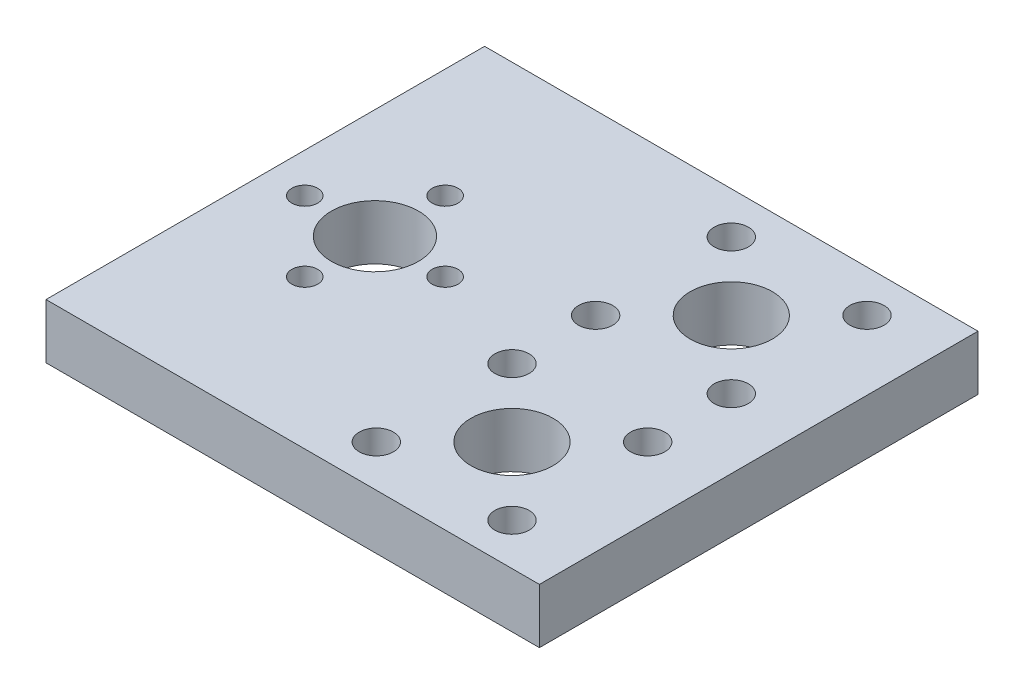
ISO-10303-21;
HEADER;
FILE_DESCRIPTION(('STEP AP214'),'2;1');
FILE_NAME('part.step','',(''),(''),'','','');
FILE_SCHEMA(('AUTOMOTIVE_DESIGN { 1 0 10303 214 1 1 1 1 }'));
ENDSEC;
DATA;
#1=APPLICATION_CONTEXT('core data for automotive mechanical design processes');
#2=APPLICATION_PROTOCOL_DEFINITION('international standard','automotive_design',2000,#1);
#3=PRODUCT_CONTEXT('',#1,'mechanical');
#4=PRODUCT('Part','Part','',(#3));
#5=PRODUCT_RELATED_PRODUCT_CATEGORY('part','',(#4));
#6=PRODUCT_DEFINITION_FORMATION('','',#4);
#7=PRODUCT_DEFINITION_CONTEXT('part definition',#1,'design');
#8=PRODUCT_DEFINITION('design','',#6,#7);
#9=PRODUCT_DEFINITION_SHAPE('','',#8);
#10=(LENGTH_UNIT() NAMED_UNIT(*) SI_UNIT(.MILLI.,.METRE.));
#11=(NAMED_UNIT(*) PLANE_ANGLE_UNIT() SI_UNIT($,.RADIAN.));
#12=(NAMED_UNIT(*) SI_UNIT($,.STERADIAN.) SOLID_ANGLE_UNIT());
#13=UNCERTAINTY_MEASURE_WITH_UNIT(LENGTH_MEASURE(1.E-05),#10,'distance_accuracy_value','');
#14=(GEOMETRIC_REPRESENTATION_CONTEXT(3) GLOBAL_UNCERTAINTY_ASSIGNED_CONTEXT((#13)) GLOBAL_UNIT_ASSIGNED_CONTEXT((#10,
#11,#12)) REPRESENTATION_CONTEXT('',''));
#15=CARTESIAN_POINT('',(0.,0.,0.));
#16=DIRECTION('',(0.,0.,1.));
#17=DIRECTION('',(1.,0.,0.));
#18=AXIS2_PLACEMENT_3D('',#15,#16,#17);
#19=CARTESIAN_POINT('',(-121.219673345069,-6.35,50.8));
#20=DIRECTION('',(1.,0.,0.));
#21=DIRECTION('',(0.,0.,-1.));
#22=AXIS2_PLACEMENT_3D('',#19,#20,#21);
#23=PLANE('',#22);
#24=DIRECTION('',(0.,-1.,0.));
#25=VECTOR('',#24,1.);
#26=CARTESIAN_POINT('',(-121.219673345069,-6.35,0.));
#27=LINE('',#26,#25);
#28=CARTESIAN_POINT('',(-121.219673345069,0.,0.));
#29=VERTEX_POINT('',#28);
#30=CARTESIAN_POINT('',(-121.219673345069,-6.35,0.));
#31=VERTEX_POINT('',#30);
#32=EDGE_CURVE('E95',#29,#31,#27,.T.);
#33=ORIENTED_EDGE('',*,*,#32,.T.);
#34=DIRECTION('',(0.,0.,-1.));
#35=VECTOR('',#34,1.);
#36=CARTESIAN_POINT('',(-121.219673345069,-6.35,50.8));
#37=LINE('',#36,#35);
#38=CARTESIAN_POINT('',(-121.219673345069,-6.35,50.8));
#39=VERTEX_POINT('',#38);
#40=EDGE_CURVE('E11',#39,#31,#37,.T.);
#41=ORIENTED_EDGE('',*,*,#40,.F.);
#42=DIRECTION('',(0.,-1.,0.));
#43=VECTOR('',#42,1.);
#44=CARTESIAN_POINT('',(-121.219673345069,-6.35,50.8));
#45=LINE('',#44,#43);
#46=CARTESIAN_POINT('',(-121.219673345069,0.,50.8));
#47=VERTEX_POINT('',#46);
#48=EDGE_CURVE('E83',#47,#39,#45,.T.);
#49=ORIENTED_EDGE('',*,*,#48,.F.);
#50=DIRECTION('',(0.,0.,-1.));
#51=VECTOR('',#50,1.);
#52=CARTESIAN_POINT('',(-121.219673345069,0.,50.8));
#53=LINE('',#52,#51);
#54=EDGE_CURVE('E91',#47,#29,#53,.T.);
#55=ORIENTED_EDGE('',*,*,#54,.T.);
#56=EDGE_LOOP('',(#33,#41,#49,#55));
#57=FACE_BOUND('',#56,.T.);
#58=ADVANCED_FACE('F32',(#57),#23,.F.);
#59=CARTESIAN_POINT('',(-64.0696733450693,-6.34999999999999,50.8));
#60=DIRECTION('',(0.,1.,0.));
#61=DIRECTION('',(-1.,0.,0.));
#62=AXIS2_PLACEMENT_3D('',#59,#60,#61);
#63=PLANE('',#62);
#64=CARTESIAN_POINT('',(-100.389673345069,-6.35,25.4));
#65=DIRECTION('',(0.,1.,0.));
#66=DIRECTION('',(-1.,0.,0.));
#67=AXIS2_PLACEMENT_3D('',#64,#65,#66);
#68=CIRCLE('',#67,1.5);
#69=CARTESIAN_POINT('',(-101.889673345069,-6.35,25.4));
#70=VERTEX_POINT('',#69);
#71=EDGE_CURVE('E139',#70,#70,#68,.F.);
#72=ORIENTED_EDGE('',*,*,#71,.F.);
#73=EDGE_LOOP('',(#72));
#74=FACE_BOUND('',#73,.T.);
#75=CARTESIAN_POINT('',(-108.519673345069,-6.35,17.27));
#76=DIRECTION('',(0.,1.,0.));
#77=DIRECTION('',(-1.,0.,0.));
#78=AXIS2_PLACEMENT_3D('',#75,#76,#77);
#79=CIRCLE('',#78,1.5);
#80=CARTESIAN_POINT('',(-110.019673345069,-6.35,17.27));
#81=VERTEX_POINT('',#80);
#82=EDGE_CURVE('E147',#81,#81,#79,.F.);
#83=ORIENTED_EDGE('',*,*,#82,.F.);
#84=EDGE_LOOP('',(#83));
#85=FACE_BOUND('',#84,.T.);
#86=CARTESIAN_POINT('',(-87.8023974510048,-6.35,45.9577241059355));
#87=DIRECTION('',(0.,1.,0.));
#88=DIRECTION('',(-1.,0.,0.));
#89=AXIS2_PLACEMENT_3D('',#86,#87,#88);
#90=CIRCLE('',#89,1.98437500000001);
#91=CARTESIAN_POINT('',(-89.7867724510048,-6.35,45.9577241059355));
#92=VERTEX_POINT('',#91);
#93=EDGE_CURVE('E153',#92,#92,#90,.F.);
#94=ORIENTED_EDGE('',*,*,#93,.F.);
#95=EDGE_LOOP('',(#94));
#96=FACE_BOUND('',#95,.T.);
#97=CARTESIAN_POINT('',(-72.0869492391337,-6.34999999999999,45.9577241059355));
#98=DIRECTION('',(0.,1.,0.));
#99=DIRECTION('',(-1.,0.,0.));
#100=AXIS2_PLACEMENT_3D('',#97,#98,#99);
#101=CIRCLE('',#100,1.98437499999999);
#102=CARTESIAN_POINT('',(-74.0713242391337,-6.34999999999999,45.9577241059355));
#103=VERTEX_POINT('',#102);
#104=EDGE_CURVE('E134',#103,#103,#101,.F.);
#105=ORIENTED_EDGE('',*,*,#104,.F.);
#106=EDGE_LOOP('',(#105));
#107=FACE_BOUND('',#106,.T.);
#108=CARTESIAN_POINT('',(-79.9446733450693,-6.34999999999999,38.1));
#109=DIRECTION('',(0.,1.,0.));
#110=DIRECTION('',(-1.,0.,0.));
#111=AXIS2_PLACEMENT_3D('',#108,#109,#110);
#112=CIRCLE('',#111,4.76250000000001);
#113=CARTESIAN_POINT('',(-84.7071733450693,-6.35,38.1));
#114=VERTEX_POINT('',#113);
#115=EDGE_CURVE('E114',#114,#114,#112,.F.);
#116=ORIENTED_EDGE('',*,*,#115,.F.);
#117=EDGE_LOOP('',(#116));
#118=FACE_BOUND('',#117,.T.);
#119=CARTESIAN_POINT('',(-87.8023974510048,-6.35,30.2422758940645));
#120=DIRECTION('',(0.,1.,0.));
#121=DIRECTION('',(-1.,0.,0.));
#122=AXIS2_PLACEMENT_3D('',#119,#120,#121);
#123=CIRCLE('',#122,1.98437499999999);
#124=CARTESIAN_POINT('',(-89.7867724510048,-6.35,30.2422758940645));
#125=VERTEX_POINT('',#124);
#126=EDGE_CURVE('E115',#125,#125,#123,.F.);
#127=ORIENTED_EDGE('',*,*,#126,.F.);
#128=EDGE_LOOP('',(#127));
#129=FACE_BOUND('',#128,.T.);
#130=CARTESIAN_POINT('',(-116.649673345069,-6.35,25.4));
#131=DIRECTION('',(0.,1.,0.));
#132=DIRECTION('',(-1.,0.,0.));
#133=AXIS2_PLACEMENT_3D('',#130,#131,#132);
#134=CIRCLE('',#133,1.5);
#135=CARTESIAN_POINT('',(-118.149673345069,-6.35,25.4));
#136=VERTEX_POINT('',#135);
#137=EDGE_CURVE('E122',#136,#136,#134,.F.);
#138=ORIENTED_EDGE('',*,*,#137,.F.);
#139=EDGE_LOOP('',(#138));
#140=FACE_BOUND('',#139,.T.);
#141=CARTESIAN_POINT('',(-72.0869492391337,-6.34999999999999,30.2422758940645));
#142=DIRECTION('',(0.,1.,0.));
#143=DIRECTION('',(-1.,0.,0.));
#144=AXIS2_PLACEMENT_3D('',#141,#142,#143);
#145=CIRCLE('',#144,1.98437500000001);
#146=CARTESIAN_POINT('',(-74.0713242391337,-6.34999999999999,30.2422758940645));
#147=VERTEX_POINT('',#146);
#148=EDGE_CURVE('E127',#147,#147,#145,.F.);
#149=ORIENTED_EDGE('',*,*,#148,.F.);
#150=EDGE_LOOP('',(#149));
#151=FACE_BOUND('',#150,.T.);
#152=CARTESIAN_POINT('',(-79.9446733450693,-6.34999999999999,12.7));
#153=DIRECTION('',(0.,1.,0.));
#154=DIRECTION('',(-1.,0.,0.));
#155=AXIS2_PLACEMENT_3D('',#152,#153,#154);
#156=CIRCLE('',#155,4.76250000000001);
#157=CARTESIAN_POINT('',(-84.7071733450693,-6.35,12.7));
#158=VERTEX_POINT('',#157);
#159=EDGE_CURVE('E187',#158,#158,#156,.F.);
#160=ORIENTED_EDGE('',*,*,#159,.F.);
#161=EDGE_LOOP('',(#160));
#162=FACE_BOUND('',#161,.T.);
#163=CARTESIAN_POINT('',(-87.8023974510048,-6.35,20.5577241059355));
#164=DIRECTION('',(0.,1.,0.));
#165=DIRECTION('',(-1.,0.,0.));
#166=AXIS2_PLACEMENT_3D('',#163,#164,#165);
#167=CIRCLE('',#166,1.98437499999999);
#168=CARTESIAN_POINT('',(-89.7867724510048,-6.35,20.5577241059355));
#169=VERTEX_POINT('',#168);
#170=EDGE_CURVE('E170',#169,#169,#167,.F.);
#171=ORIENTED_EDGE('',*,*,#170,.F.);
#172=EDGE_LOOP('',(#171));
#173=FACE_BOUND('',#172,.T.);
#174=CARTESIAN_POINT('',(-72.0869492391337,-6.34999999999999,20.5577241059355));
#175=DIRECTION('',(0.,1.,0.));
#176=DIRECTION('',(-1.,0.,0.));
#177=AXIS2_PLACEMENT_3D('',#174,#175,#176);
#178=CIRCLE('',#177,1.98437500000001);
#179=CARTESIAN_POINT('',(-74.0713242391337,-6.34999999999999,20.5577241059355));
#180=VERTEX_POINT('',#179);
#181=EDGE_CURVE('E163',#180,#180,#178,.F.);
#182=ORIENTED_EDGE('',*,*,#181,.F.);
#183=EDGE_LOOP('',(#182));
#184=FACE_BOUND('',#183,.T.);
#185=CARTESIAN_POINT('',(-72.0869492391337,-6.34999999999999,4.84227589406446));
#186=DIRECTION('',(0.,1.,0.));
#187=DIRECTION('',(-1.,0.,0.));
#188=AXIS2_PLACEMENT_3D('',#185,#186,#187);
#189=CIRCLE('',#188,1.984375);
#190=CARTESIAN_POINT('',(-74.0713242391337,-6.34999999999999,4.84227589406446));
#191=VERTEX_POINT('',#190);
#192=EDGE_CURVE('E171',#191,#191,#189,.F.);
#193=ORIENTED_EDGE('',*,*,#192,.F.);
#194=EDGE_LOOP('',(#193));
#195=FACE_BOUND('',#194,.T.);
#196=CARTESIAN_POINT('',(-87.8023974510048,-6.35,4.84227589406448));
#197=DIRECTION('',(0.,1.,0.));
#198=DIRECTION('',(-1.,0.,0.));
#199=AXIS2_PLACEMENT_3D('',#196,#197,#198);
#200=CIRCLE('',#199,1.98437500000001);
#201=CARTESIAN_POINT('',(-89.7867724510048,-6.35,4.84227589406448));
#202=VERTEX_POINT('',#201);
#203=EDGE_CURVE('E177',#202,#202,#200,.F.);
#204=ORIENTED_EDGE('',*,*,#203,.F.);
#205=EDGE_LOOP('',(#204));
#206=FACE_BOUND('',#205,.T.);
#207=CARTESIAN_POINT('',(-108.519673345069,-6.35,33.53));
#208=DIRECTION('',(0.,1.,0.));
#209=DIRECTION('',(-1.,0.,0.));
#210=AXIS2_PLACEMENT_3D('',#207,#208,#209);
#211=CIRCLE('',#210,1.5);
#212=CARTESIAN_POINT('',(-110.019673345069,-6.35,33.53));
#213=VERTEX_POINT('',#212);
#214=EDGE_CURVE('E146',#213,#213,#211,.F.);
#215=ORIENTED_EDGE('',*,*,#214,.F.);
#216=EDGE_LOOP('',(#215));
#217=FACE_BOUND('',#216,.T.);
#218=CARTESIAN_POINT('',(-108.519673345069,-6.35,25.4));
#219=DIRECTION('',(0.,1.,0.));
#220=DIRECTION('',(-1.,0.,0.));
#221=AXIS2_PLACEMENT_3D('',#218,#219,#220);
#222=CIRCLE('',#221,5.05);
#223=CARTESIAN_POINT('',(-113.569673345069,-6.35,25.4));
#224=VERTEX_POINT('',#223);
#225=EDGE_CURVE('E98',#224,#224,#222,.F.);
#226=ORIENTED_EDGE('',*,*,#225,.F.);
#227=EDGE_LOOP('',(#226));
#228=FACE_BOUND('',#227,.T.);
#229=DIRECTION('',(1.,0.,0.));
#230=VECTOR('',#229,1.);
#231=CARTESIAN_POINT('',(-64.0696733450693,-6.34999999999999,0.));
#232=LINE('',#231,#230);
#233=CARTESIAN_POINT('',(-64.0696733450693,-6.34999999999999,0.));
#234=VERTEX_POINT('',#233);
#235=EDGE_CURVE('E87',#31,#234,#232,.T.);
#236=ORIENTED_EDGE('',*,*,#235,.T.);
#237=DIRECTION('',(0.,0.,-1.));
#238=VECTOR('',#237,1.);
#239=CARTESIAN_POINT('',(-64.0696733450693,-6.34999999999999,50.8));
#240=LINE('',#239,#238);
#241=CARTESIAN_POINT('',(-64.0696733450693,-6.34999999999999,50.8));
#242=VERTEX_POINT('',#241);
#243=EDGE_CURVE('E40',#242,#234,#240,.T.);
#244=ORIENTED_EDGE('',*,*,#243,.F.);
#245=DIRECTION('',(1.,0.,0.));
#246=VECTOR('',#245,1.);
#247=CARTESIAN_POINT('',(-64.0696733450693,-6.34999999999999,50.8));
#248=LINE('',#247,#246);
#249=EDGE_CURVE('E78',#39,#242,#248,.T.);
#250=ORIENTED_EDGE('',*,*,#249,.F.);
#251=ORIENTED_EDGE('',*,*,#40,.T.);
#252=EDGE_LOOP('',(#236,#244,#250,#251));
#253=FACE_BOUND('',#252,.T.);
#254=ADVANCED_FACE('F86',(#74,#85,#96,#107,#118,#129,#140,#151,#162,#173,#184,#195,#206,#217,
#228,#253),#63,.F.);
#255=CARTESIAN_POINT('',(-64.0696733450693,-6.34999999999999,50.8));
#256=DIRECTION('',(-1.,0.,0.));
#257=DIRECTION('',(0.,0.,1.));
#258=AXIS2_PLACEMENT_3D('',#255,#256,#257);
#259=PLANE('',#258);
#260=DIRECTION('',(0.,1.,0.));
#261=VECTOR('',#260,1.);
#262=CARTESIAN_POINT('',(-64.0696733450693,-6.34999999999999,0.));
#263=LINE('',#262,#261);
#264=CARTESIAN_POINT('',(-64.0696733450693,0.,0.));
#265=VERTEX_POINT('',#264);
#266=EDGE_CURVE('E65',#234,#265,#263,.T.);
#267=ORIENTED_EDGE('',*,*,#266,.T.);
#268=DIRECTION('',(0.,0.,-1.));
#269=VECTOR('',#268,1.);
#270=CARTESIAN_POINT('',(-64.0696733450693,0.,50.8));
#271=LINE('',#270,#269);
#272=CARTESIAN_POINT('',(-64.0696733450693,0.,50.8));
#273=VERTEX_POINT('',#272);
#274=EDGE_CURVE('E88',#273,#265,#271,.T.);
#275=ORIENTED_EDGE('',*,*,#274,.F.);
#276=DIRECTION('',(0.,1.,0.));
#277=VECTOR('',#276,1.);
#278=CARTESIAN_POINT('',(-64.0696733450693,-6.34999999999999,50.8));
#279=LINE('',#278,#277);
#280=EDGE_CURVE('E81',#242,#273,#279,.T.);
#281=ORIENTED_EDGE('',*,*,#280,.F.);
#282=ORIENTED_EDGE('',*,*,#243,.T.);
#283=EDGE_LOOP('',(#267,#275,#281,#282));
#284=FACE_BOUND('',#283,.T.);
#285=ADVANCED_FACE('F89',(#284),#259,.F.);
#286=CARTESIAN_POINT('',(-121.219673345069,0.,50.8));
#287=DIRECTION('',(0.,-1.,0.));
#288=DIRECTION('',(0.,0.,-1.));
#289=AXIS2_PLACEMENT_3D('',#286,#287,#288);
#290=PLANE('',#289);
#291=CARTESIAN_POINT('',(-100.389673345069,0.,25.4));
#292=DIRECTION('',(0.,1.,0.));
#293=DIRECTION('',(0.,0.,1.));
#294=AXIS2_PLACEMENT_3D('',#291,#292,#293);
#295=CIRCLE('',#294,1.5);
#296=CARTESIAN_POINT('',(-100.389673345069,0.,26.9));
#297=VERTEX_POINT('',#296);
#298=EDGE_CURVE('E143',#297,#297,#295,.T.);
#299=ORIENTED_EDGE('',*,*,#298,.F.);
#300=EDGE_LOOP('',(#299));
#301=FACE_BOUND('',#300,.T.);
#302=CARTESIAN_POINT('',(-108.519673345069,0.,17.27));
#303=DIRECTION('',(0.,1.,0.));
#304=DIRECTION('',(0.,0.,1.));
#305=AXIS2_PLACEMENT_3D('',#302,#303,#304);
#306=CIRCLE('',#305,1.5);
#307=CARTESIAN_POINT('',(-108.519673345069,0.,18.77));
#308=VERTEX_POINT('',#307);
#309=EDGE_CURVE('E142',#308,#308,#306,.T.);
#310=ORIENTED_EDGE('',*,*,#309,.F.);
#311=EDGE_LOOP('',(#310));
#312=FACE_BOUND('',#311,.T.);
#313=CARTESIAN_POINT('',(-87.8023974510048,0.,45.9577241059355));
#314=DIRECTION('',(0.,1.,0.));
#315=DIRECTION('',(0.,0.,1.));
#316=AXIS2_PLACEMENT_3D('',#313,#314,#315);
#317=CIRCLE('',#316,1.98437500000001);
#318=CARTESIAN_POINT('',(-87.8023974510048,0.,47.9420991059355));
#319=VERTEX_POINT('',#318);
#320=EDGE_CURVE('E150',#319,#319,#317,.T.);
#321=ORIENTED_EDGE('',*,*,#320,.F.);
#322=EDGE_LOOP('',(#321));
#323=FACE_BOUND('',#322,.T.);
#324=CARTESIAN_POINT('',(-72.0869492391337,0.,45.9577241059355));
#325=DIRECTION('',(0.,1.,0.));
#326=DIRECTION('',(0.,0.,1.));
#327=AXIS2_PLACEMENT_3D('',#324,#325,#326);
#328=CIRCLE('',#327,1.98437499999999);
#329=CARTESIAN_POINT('',(-72.0869492391337,0.,47.9420991059355));
#330=VERTEX_POINT('',#329);
#331=EDGE_CURVE('E156',#330,#330,#328,.T.);
#332=ORIENTED_EDGE('',*,*,#331,.F.);
#333=EDGE_LOOP('',(#332));
#334=FACE_BOUND('',#333,.T.);
#335=CARTESIAN_POINT('',(-79.9446733450693,0.,38.1));
#336=DIRECTION('',(0.,1.,0.));
#337=DIRECTION('',(0.,0.,-1.));
#338=AXIS2_PLACEMENT_3D('',#335,#336,#337);
#339=CIRCLE('',#338,4.76250000000001);
#340=CARTESIAN_POINT('',(-79.9446733450693,0.,33.3375));
#341=VERTEX_POINT('',#340);
#342=EDGE_CURVE('E118',#341,#341,#339,.T.);
#343=ORIENTED_EDGE('',*,*,#342,.F.);
#344=EDGE_LOOP('',(#343));
#345=FACE_BOUND('',#344,.T.);
#346=CARTESIAN_POINT('',(-87.8023974510048,0.,30.2422758940645));
#347=DIRECTION('',(0.,1.,0.));
#348=DIRECTION('',(0.,0.,1.));
#349=AXIS2_PLACEMENT_3D('',#346,#347,#348);
#350=CIRCLE('',#349,1.98437499999999);
#351=CARTESIAN_POINT('',(-87.8023974510048,0.,32.2266508940645));
#352=VERTEX_POINT('',#351);
#353=EDGE_CURVE('E119',#352,#352,#350,.T.);
#354=ORIENTED_EDGE('',*,*,#353,.F.);
#355=EDGE_LOOP('',(#354));
#356=FACE_BOUND('',#355,.T.);
#357=CARTESIAN_POINT('',(-116.649673345069,0.,25.4));
#358=DIRECTION('',(0.,1.,0.));
#359=DIRECTION('',(0.,0.,1.));
#360=AXIS2_PLACEMENT_3D('',#357,#358,#359);
#361=CIRCLE('',#360,1.5);
#362=CARTESIAN_POINT('',(-116.649673345069,0.,26.9));
#363=VERTEX_POINT('',#362);
#364=EDGE_CURVE('E130',#363,#363,#361,.T.);
#365=ORIENTED_EDGE('',*,*,#364,.F.);
#366=EDGE_LOOP('',(#365));
#367=FACE_BOUND('',#366,.T.);
#368=CARTESIAN_POINT('',(-72.0869492391337,0.,30.2422758940645));
#369=DIRECTION('',(0.,1.,0.));
#370=DIRECTION('',(0.,0.,1.));
#371=AXIS2_PLACEMENT_3D('',#368,#369,#370);
#372=CIRCLE('',#371,1.98437500000001);
#373=CARTESIAN_POINT('',(-72.0869492391337,0.,32.2266508940645));
#374=VERTEX_POINT('',#373);
#375=EDGE_CURVE('E131',#374,#374,#372,.T.);
#376=ORIENTED_EDGE('',*,*,#375,.F.);
#377=EDGE_LOOP('',(#376));
#378=FACE_BOUND('',#377,.T.);
#379=CARTESIAN_POINT('',(-79.9446733450693,0.,12.7));
#380=DIRECTION('',(0.,1.,0.));
#381=DIRECTION('',(0.,0.,1.));
#382=AXIS2_PLACEMENT_3D('',#379,#380,#381);
#383=CIRCLE('',#382,4.76250000000001);
#384=CARTESIAN_POINT('',(-79.9446733450693,0.,17.4625));
#385=VERTEX_POINT('',#384);
#386=EDGE_CURVE('E191',#385,#385,#383,.T.);
#387=ORIENTED_EDGE('',*,*,#386,.F.);
#388=EDGE_LOOP('',(#387));
#389=FACE_BOUND('',#388,.T.);
#390=CARTESIAN_POINT('',(-87.8023974510048,0.,20.5577241059355));
#391=DIRECTION('',(0.,1.,0.));
#392=DIRECTION('',(0.,0.,-1.));
#393=AXIS2_PLACEMENT_3D('',#390,#391,#392);
#394=CIRCLE('',#393,1.98437499999999);
#395=CARTESIAN_POINT('',(-87.8023974510048,0.,18.5733491059355));
#396=VERTEX_POINT('',#395);
#397=EDGE_CURVE('E190',#396,#396,#394,.T.);
#398=ORIENTED_EDGE('',*,*,#397,.F.);
#399=EDGE_LOOP('',(#398));
#400=FACE_BOUND('',#399,.T.);
#401=CARTESIAN_POINT('',(-72.0869492391337,0.,20.5577241059355));
#402=DIRECTION('',(0.,1.,0.));
#403=DIRECTION('',(0.,0.,-1.));
#404=AXIS2_PLACEMENT_3D('',#401,#402,#403);
#405=CIRCLE('',#404,1.98437500000001);
#406=CARTESIAN_POINT('',(-72.0869492391337,0.,18.5733491059355));
#407=VERTEX_POINT('',#406);
#408=EDGE_CURVE('E167',#407,#407,#405,.T.);
#409=ORIENTED_EDGE('',*,*,#408,.F.);
#410=EDGE_LOOP('',(#409));
#411=FACE_BOUND('',#410,.T.);
#412=CARTESIAN_POINT('',(-72.0869492391337,0.,4.84227589406446));
#413=DIRECTION('',(0.,1.,0.));
#414=DIRECTION('',(0.,0.,-1.));
#415=AXIS2_PLACEMENT_3D('',#412,#413,#414);
#416=CIRCLE('',#415,1.984375);
#417=CARTESIAN_POINT('',(-72.0869492391337,0.,2.85790089406447));
#418=VERTEX_POINT('',#417);
#419=EDGE_CURVE('E166',#418,#418,#416,.T.);
#420=ORIENTED_EDGE('',*,*,#419,.F.);
#421=EDGE_LOOP('',(#420));
#422=FACE_BOUND('',#421,.T.);
#423=CARTESIAN_POINT('',(-87.8023974510048,0.,4.84227589406448));
#424=DIRECTION('',(0.,1.,0.));
#425=DIRECTION('',(0.,0.,-1.));
#426=AXIS2_PLACEMENT_3D('',#423,#424,#425);
#427=CIRCLE('',#426,1.98437500000001);
#428=CARTESIAN_POINT('',(-87.8023974510048,0.,2.85790089406447));
#429=VERTEX_POINT('',#428);
#430=EDGE_CURVE('E174',#429,#429,#427,.T.);
#431=ORIENTED_EDGE('',*,*,#430,.F.);
#432=EDGE_LOOP('',(#431));
#433=FACE_BOUND('',#432,.T.);
#434=CARTESIAN_POINT('',(-108.519673345069,0.,33.53));
#435=DIRECTION('',(0.,1.,0.));
#436=DIRECTION('',(0.,0.,1.));
#437=AXIS2_PLACEMENT_3D('',#434,#435,#436);
#438=CIRCLE('',#437,1.5);
#439=CARTESIAN_POINT('',(-108.519673345069,0.,35.03));
#440=VERTEX_POINT('',#439);
#441=EDGE_CURVE('E180',#440,#440,#438,.T.);
#442=ORIENTED_EDGE('',*,*,#441,.F.);
#443=EDGE_LOOP('',(#442));
#444=FACE_BOUND('',#443,.T.);
#445=CARTESIAN_POINT('',(-108.519673345069,0.,25.4));
#446=DIRECTION('',(0.,1.,0.));
#447=DIRECTION('',(0.,0.,1.));
#448=AXIS2_PLACEMENT_3D('',#445,#446,#447);
#449=CIRCLE('',#448,5.05);
#450=CARTESIAN_POINT('',(-108.519673345069,0.,30.45));
#451=VERTEX_POINT('',#450);
#452=EDGE_CURVE('E111',#451,#451,#449,.T.);
#453=ORIENTED_EDGE('',*,*,#452,.F.);
#454=EDGE_LOOP('',(#453));
#455=FACE_BOUND('',#454,.T.);
#456=DIRECTION('',(-1.,0.,0.));
#457=VECTOR('',#456,1.);
#458=CARTESIAN_POINT('',(-121.219673345069,0.,0.));
#459=LINE('',#458,#457);
#460=EDGE_CURVE('E71',#265,#29,#459,.T.);
#461=ORIENTED_EDGE('',*,*,#460,.T.);
#462=ORIENTED_EDGE('',*,*,#54,.F.);
#463=DIRECTION('',(-1.,0.,0.));
#464=VECTOR('',#463,1.);
#465=CARTESIAN_POINT('',(-121.219673345069,0.,50.8));
#466=LINE('',#465,#464);
#467=EDGE_CURVE('E48',#273,#47,#466,.T.);
#468=ORIENTED_EDGE('',*,*,#467,.F.);
#469=ORIENTED_EDGE('',*,*,#274,.T.);
#470=EDGE_LOOP('',(#461,#462,#468,#469));
#471=FACE_BOUND('',#470,.T.);
#472=ADVANCED_FACE('F103',(#301,#312,#323,#334,#345,#356,#367,#378,#389,#400,#411,#422,#433,
#444,#455,#471),#290,.F.);
#473=CARTESIAN_POINT('',(0.,0.,50.8));
#474=DIRECTION('',(0.,0.,-1.));
#475=DIRECTION('',(-1.,0.,0.));
#476=AXIS2_PLACEMENT_3D('',#473,#474,#475);
#477=PLANE('',#476);
#478=ORIENTED_EDGE('',*,*,#48,.T.);
#479=ORIENTED_EDGE('',*,*,#249,.T.);
#480=ORIENTED_EDGE('',*,*,#280,.T.);
#481=ORIENTED_EDGE('',*,*,#467,.T.);
#482=EDGE_LOOP('',(#478,#479,#480,#481));
#483=FACE_BOUND('',#482,.T.);
#484=ADVANCED_FACE('F79',(#483),#477,.F.);
#485=CARTESIAN_POINT('',(0.,0.,0.));
#486=DIRECTION('',(0.,0.,-1.));
#487=DIRECTION('',(-1.,0.,0.));
#488=AXIS2_PLACEMENT_3D('',#485,#486,#487);
#489=PLANE('',#488);
#490=ORIENTED_EDGE('',*,*,#32,.F.);
#491=ORIENTED_EDGE('',*,*,#460,.F.);
#492=ORIENTED_EDGE('',*,*,#266,.F.);
#493=ORIENTED_EDGE('',*,*,#235,.F.);
#494=EDGE_LOOP('',(#490,#491,#492,#493));
#495=FACE_BOUND('',#494,.T.);
#496=ADVANCED_FACE('F106',(#495),#489,.T.);
#497=CARTESIAN_POINT('',(-108.519673345069,-20.6335569799683,25.4));
#498=DIRECTION('',(0.,1.,0.));
#499=DIRECTION('',(0.,0.,1.));
#500=AXIS2_PLACEMENT_3D('',#497,#498,#499);
#501=CYLINDRICAL_SURFACE('',#500,5.05);
#502=ORIENTED_EDGE('',*,*,#225,.T.);
#503=EDGE_LOOP('',(#502));
#504=FACE_BOUND('',#503,.T.);
#505=ORIENTED_EDGE('',*,*,#452,.T.);
#506=EDGE_LOOP('',(#505));
#507=FACE_BOUND('',#506,.T.);
#508=ADVANCED_FACE('F215',(#504,#507),#501,.F.);
#509=CARTESIAN_POINT('',(-108.519673345069,-20.6335569799683,33.53));
#510=DIRECTION('',(0.,1.,0.));
#511=DIRECTION('',(0.,0.,1.));
#512=AXIS2_PLACEMENT_3D('',#509,#510,#511);
#513=CYLINDRICAL_SURFACE('',#512,1.5);
#514=ORIENTED_EDGE('',*,*,#214,.T.);
#515=EDGE_LOOP('',(#514));
#516=FACE_BOUND('',#515,.T.);
#517=ORIENTED_EDGE('',*,*,#441,.T.);
#518=EDGE_LOOP('',(#517));
#519=FACE_BOUND('',#518,.T.);
#520=ADVANCED_FACE('F217',(#516,#519),#513,.F.);
#521=CARTESIAN_POINT('',(-87.8023974510048,-20.6335569799683,4.84227589406448));
#522=DIRECTION('',(0.,1.,0.));
#523=DIRECTION('',(0.,0.,1.));
#524=AXIS2_PLACEMENT_3D('',#521,#522,#523);
#525=CYLINDRICAL_SURFACE('',#524,1.98437500000001);
#526=ORIENTED_EDGE('',*,*,#203,.T.);
#527=EDGE_LOOP('',(#526));
#528=FACE_BOUND('',#527,.T.);
#529=ORIENTED_EDGE('',*,*,#430,.T.);
#530=EDGE_LOOP('',(#529));
#531=FACE_BOUND('',#530,.T.);
#532=ADVANCED_FACE('F224',(#528,#531),#525,.F.);
#533=CARTESIAN_POINT('',(-72.0869492391337,-20.6335569799683,4.84227589406446));
#534=DIRECTION('',(0.,1.,0.));
#535=DIRECTION('',(0.,0.,1.));
#536=AXIS2_PLACEMENT_3D('',#533,#534,#535);
#537=CYLINDRICAL_SURFACE('',#536,1.984375);
#538=ORIENTED_EDGE('',*,*,#192,.T.);
#539=EDGE_LOOP('',(#538));
#540=FACE_BOUND('',#539,.T.);
#541=ORIENTED_EDGE('',*,*,#419,.T.);
#542=EDGE_LOOP('',(#541));
#543=FACE_BOUND('',#542,.T.);
#544=ADVANCED_FACE('F273',(#540,#543),#537,.F.);
#545=CARTESIAN_POINT('',(-72.0869492391337,-20.6335569799683,20.5577241059355));
#546=DIRECTION('',(0.,1.,0.));
#547=DIRECTION('',(0.,0.,1.));
#548=AXIS2_PLACEMENT_3D('',#545,#546,#547);
#549=CYLINDRICAL_SURFACE('',#548,1.98437500000001);
#550=ORIENTED_EDGE('',*,*,#181,.T.);
#551=EDGE_LOOP('',(#550));
#552=FACE_BOUND('',#551,.T.);
#553=ORIENTED_EDGE('',*,*,#408,.T.);
#554=EDGE_LOOP('',(#553));
#555=FACE_BOUND('',#554,.T.);
#556=ADVANCED_FACE('F282',(#552,#555),#549,.F.);
#557=CARTESIAN_POINT('',(-87.8023974510048,-20.6335569799683,20.5577241059355));
#558=DIRECTION('',(0.,1.,0.));
#559=DIRECTION('',(0.,0.,1.));
#560=AXIS2_PLACEMENT_3D('',#557,#558,#559);
#561=CYLINDRICAL_SURFACE('',#560,1.98437499999999);
#562=ORIENTED_EDGE('',*,*,#170,.T.);
#563=EDGE_LOOP('',(#562));
#564=FACE_BOUND('',#563,.T.);
#565=ORIENTED_EDGE('',*,*,#397,.T.);
#566=EDGE_LOOP('',(#565));
#567=FACE_BOUND('',#566,.T.);
#568=ADVANCED_FACE('F199',(#564,#567),#561,.F.);
#569=CARTESIAN_POINT('',(-79.9446733450693,-20.6335569799683,12.7));
#570=DIRECTION('',(0.,1.,0.));
#571=DIRECTION('',(0.,0.,1.));
#572=AXIS2_PLACEMENT_3D('',#569,#570,#571);
#573=CYLINDRICAL_SURFACE('',#572,4.76250000000001);
#574=ORIENTED_EDGE('',*,*,#159,.T.);
#575=EDGE_LOOP('',(#574));
#576=FACE_BOUND('',#575,.T.);
#577=ORIENTED_EDGE('',*,*,#386,.T.);
#578=EDGE_LOOP('',(#577));
#579=FACE_BOUND('',#578,.T.);
#580=ADVANCED_FACE('F299',(#576,#579),#573,.F.);
#581=CARTESIAN_POINT('',(-72.0869492391337,-20.6335569799683,30.2422758940645));
#582=DIRECTION('',(0.,1.,0.));
#583=DIRECTION('',(0.,0.,1.));
#584=AXIS2_PLACEMENT_3D('',#581,#582,#583);
#585=CYLINDRICAL_SURFACE('',#584,1.98437500000001);
#586=ORIENTED_EDGE('',*,*,#148,.T.);
#587=EDGE_LOOP('',(#586));
#588=FACE_BOUND('',#587,.T.);
#589=ORIENTED_EDGE('',*,*,#375,.T.);
#590=EDGE_LOOP('',(#589));
#591=FACE_BOUND('',#590,.T.);
#592=ADVANCED_FACE('F308',(#588,#591),#585,.F.);
#593=CARTESIAN_POINT('',(-116.649673345069,-20.6335569799683,25.4));
#594=DIRECTION('',(0.,1.,0.));
#595=DIRECTION('',(0.,0.,1.));
#596=AXIS2_PLACEMENT_3D('',#593,#594,#595);
#597=CYLINDRICAL_SURFACE('',#596,1.5);
#598=ORIENTED_EDGE('',*,*,#137,.T.);
#599=EDGE_LOOP('',(#598));
#600=FACE_BOUND('',#599,.T.);
#601=ORIENTED_EDGE('',*,*,#364,.T.);
#602=EDGE_LOOP('',(#601));
#603=FACE_BOUND('',#602,.T.);
#604=ADVANCED_FACE('F317',(#600,#603),#597,.F.);
#605=CARTESIAN_POINT('',(-87.8023974510048,-20.6335569799683,30.2422758940645));
#606=DIRECTION('',(0.,1.,0.));
#607=DIRECTION('',(0.,0.,1.));
#608=AXIS2_PLACEMENT_3D('',#605,#606,#607);
#609=CYLINDRICAL_SURFACE('',#608,1.98437499999999);
#610=ORIENTED_EDGE('',*,*,#126,.T.);
#611=EDGE_LOOP('',(#610));
#612=FACE_BOUND('',#611,.T.);
#613=ORIENTED_EDGE('',*,*,#353,.T.);
#614=EDGE_LOOP('',(#613));
#615=FACE_BOUND('',#614,.T.);
#616=ADVANCED_FACE('F326',(#612,#615),#609,.F.);
#617=CARTESIAN_POINT('',(-79.9446733450693,-20.6335569799683,38.1));
#618=DIRECTION('',(0.,1.,0.));
#619=DIRECTION('',(0.,0.,1.));
#620=AXIS2_PLACEMENT_3D('',#617,#618,#619);
#621=CYLINDRICAL_SURFACE('',#620,4.76250000000001);
#622=ORIENTED_EDGE('',*,*,#115,.T.);
#623=EDGE_LOOP('',(#622));
#624=FACE_BOUND('',#623,.T.);
#625=ORIENTED_EDGE('',*,*,#342,.T.);
#626=EDGE_LOOP('',(#625));
#627=FACE_BOUND('',#626,.T.);
#628=ADVANCED_FACE('F335',(#624,#627),#621,.F.);
#629=CARTESIAN_POINT('',(-72.0869492391337,-20.6335569799683,45.9577241059355));
#630=DIRECTION('',(0.,1.,0.));
#631=DIRECTION('',(0.,0.,1.));
#632=AXIS2_PLACEMENT_3D('',#629,#630,#631);
#633=CYLINDRICAL_SURFACE('',#632,1.98437499999999);
#634=ORIENTED_EDGE('',*,*,#104,.T.);
#635=EDGE_LOOP('',(#634));
#636=FACE_BOUND('',#635,.T.);
#637=ORIENTED_EDGE('',*,*,#331,.T.);
#638=EDGE_LOOP('',(#637));
#639=FACE_BOUND('',#638,.T.);
#640=ADVANCED_FACE('F343',(#636,#639),#633,.F.);
#641=CARTESIAN_POINT('',(-87.8023974510048,-20.6335569799683,45.9577241059355));
#642=DIRECTION('',(0.,1.,0.));
#643=DIRECTION('',(0.,0.,1.));
#644=AXIS2_PLACEMENT_3D('',#641,#642,#643);
#645=CYLINDRICAL_SURFACE('',#644,1.98437500000001);
#646=ORIENTED_EDGE('',*,*,#93,.T.);
#647=EDGE_LOOP('',(#646));
#648=FACE_BOUND('',#647,.T.);
#649=ORIENTED_EDGE('',*,*,#320,.T.);
#650=EDGE_LOOP('',(#649));
#651=FACE_BOUND('',#650,.T.);
#652=ADVANCED_FACE('F352',(#648,#651),#645,.F.);
#653=CARTESIAN_POINT('',(-108.519673345069,-20.6335569799683,17.27));
#654=DIRECTION('',(0.,1.,0.));
#655=DIRECTION('',(0.,0.,1.));
#656=AXIS2_PLACEMENT_3D('',#653,#654,#655);
#657=CYLINDRICAL_SURFACE('',#656,1.5);
#658=ORIENTED_EDGE('',*,*,#82,.T.);
#659=EDGE_LOOP('',(#658));
#660=FACE_BOUND('',#659,.T.);
#661=ORIENTED_EDGE('',*,*,#309,.T.);
#662=EDGE_LOOP('',(#661));
#663=FACE_BOUND('',#662,.T.);
#664=ADVANCED_FACE('F361',(#660,#663),#657,.F.);
#665=CARTESIAN_POINT('',(-100.389673345069,-20.6335569799683,25.4));
#666=DIRECTION('',(0.,1.,0.));
#667=DIRECTION('',(0.,0.,1.));
#668=AXIS2_PLACEMENT_3D('',#665,#666,#667);
#669=CYLINDRICAL_SURFACE('',#668,1.5);
#670=ORIENTED_EDGE('',*,*,#71,.T.);
#671=EDGE_LOOP('',(#670));
#672=FACE_BOUND('',#671,.T.);
#673=ORIENTED_EDGE('',*,*,#298,.T.);
#674=EDGE_LOOP('',(#673));
#675=FACE_BOUND('',#674,.T.);
#676=ADVANCED_FACE('F370',(#672,#675),#669,.F.);
#677=CLOSED_SHELL('',(#58,#254,#285,#472,#484,#496,#508,#520,#532,#544,#556,#568,#580,#592,#604,
#616,#628,#640,#652,#664,#676));
#678=MANIFOLD_SOLID_BREP('B2',#677);
#679=ADVANCED_BREP_SHAPE_REPRESENTATION('',(#18,#678),#14);
#680=SHAPE_DEFINITION_REPRESENTATION(#9,#679);
ENDSEC;
END-ISO-10303-21;
